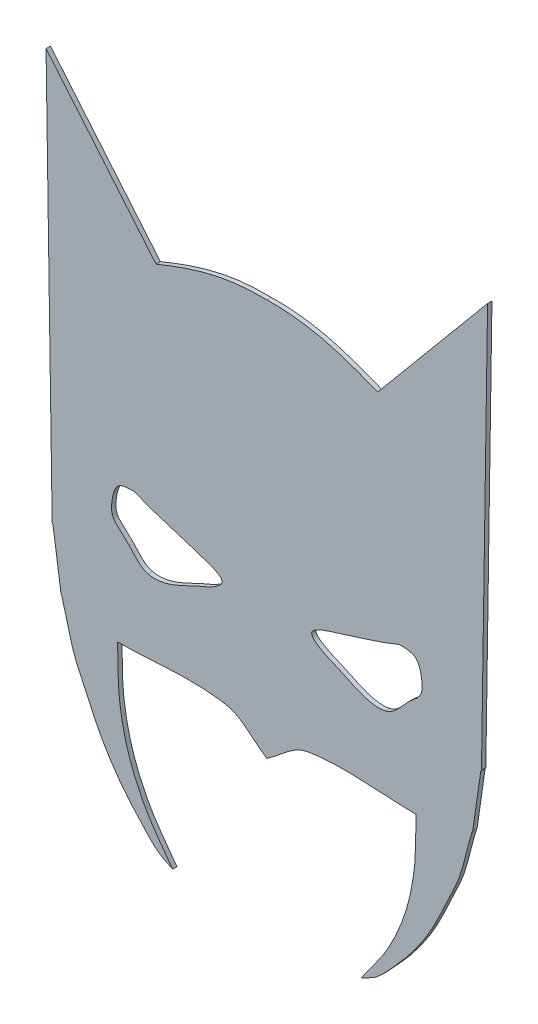
ISO-10303-21;
HEADER;
FILE_DESCRIPTION(('STEP AP214'),'2;1');
FILE_NAME('part.step','',(''),(''),'','','');
FILE_SCHEMA(('AUTOMOTIVE_DESIGN { 1 0 10303 214 1 1 1 1 }'));
ENDSEC;
DATA;
#1=APPLICATION_CONTEXT('core data for automotive mechanical design processes');
#2=APPLICATION_PROTOCOL_DEFINITION('international standard','automotive_design',2000,#1);
#3=PRODUCT_CONTEXT('',#1,'mechanical');
#4=PRODUCT('Part','Part','',(#3));
#5=PRODUCT_RELATED_PRODUCT_CATEGORY('part','',(#4));
#6=PRODUCT_DEFINITION_FORMATION('','',#4);
#7=PRODUCT_DEFINITION_CONTEXT('part definition',#1,'design');
#8=PRODUCT_DEFINITION('design','',#6,#7);
#9=PRODUCT_DEFINITION_SHAPE('','',#8);
#10=(LENGTH_UNIT() NAMED_UNIT(*) SI_UNIT(.MILLI.,.METRE.));
#11=(NAMED_UNIT(*) PLANE_ANGLE_UNIT() SI_UNIT($,.RADIAN.));
#12=(NAMED_UNIT(*) SI_UNIT($,.STERADIAN.) SOLID_ANGLE_UNIT());
#13=UNCERTAINTY_MEASURE_WITH_UNIT(LENGTH_MEASURE(1.E-05),#10,'distance_accuracy_value','');
#14=(GEOMETRIC_REPRESENTATION_CONTEXT(3) GLOBAL_UNCERTAINTY_ASSIGNED_CONTEXT((#13)) GLOBAL_UNIT_ASSIGNED_CONTEXT((#10,
#11,#12)) REPRESENTATION_CONTEXT('',''));
#15=CARTESIAN_POINT('',(0.,0.,0.));
#16=DIRECTION('',(0.,0.,1.));
#17=DIRECTION('',(1.,0.,0.));
#18=AXIS2_PLACEMENT_3D('',#15,#16,#17);
#19=CARTESIAN_POINT('',(293.908129118495,755.03354198734,5.));
#20=DIRECTION('',(0.,0.,-1.));
#21=DIRECTION('',(-1.,0.,0.));
#22=AXIS2_PLACEMENT_3D('',#19,#20,#21);
#23=PLANE('',#22);
#24=CARTESIAN_POINT('',(223.,422.000000000001,5.));
#25=CARTESIAN_POINT('',(241.565185989729,417.780639547789,5.));
#26=CARTESIAN_POINT('',(262.475974061569,430.564188327707,5.));
#27=CARTESIAN_POINT('',(279.,438.,5.));
#28=CARTESIAN_POINT('',(280.75701930223,438.790658686004,5.));
#29=CARTESIAN_POINT('',(317.580734699677,452.013760928803,5.));
#30=CARTESIAN_POINT('',(305.,461.,5.));
#31=CARTESIAN_POINT('',(301.36087328563,463.59937622455,5.));
#32=CARTESIAN_POINT('',(297.218889993597,465.516434287966,5.));
#33=CARTESIAN_POINT('',(293.,467.,5.));
#34=CARTESIAN_POINT('',(264.460492004454,477.035870943489,5.));
#35=CARTESIAN_POINT('',(234.806563628807,484.08290130194,5.));
#36=CARTESIAN_POINT('',(207.,496.,5.));
#37=B_SPLINE_CURVE_WITH_KNOTS('',3,(#24,#25,#26,#27,#28,#29,#30,#31,#32,#33,#34,#35,#36),
.UNSPECIFIED.,.F.,.F.,(4,3,3,3,4),(5.,6.,7.,8.,9.),.UNSPECIFIED.);
#38=CARTESIAN_POINT('',(223.,422.000000000001,5.));
#39=VERTEX_POINT('',#38);
#40=CARTESIAN_POINT('',(207.,496.,5.));
#41=VERTEX_POINT('',#40);
#42=EDGE_CURVE('E187',#39,#41,#37,.T.);
#43=ORIENTED_EDGE('',*,*,#42,.F.);
#44=CARTESIAN_POINT('',(207.,496.,5.));
#45=CARTESIAN_POINT('',(198.42482415111,495.387487439365,5.));
#46=CARTESIAN_POINT('',(189.089897125206,496.543093292148,5.));
#47=CARTESIAN_POINT('',(185.,487.,5.));
#48=CARTESIAN_POINT('',(183.629120594353,483.801281386823,5.));
#49=CARTESIAN_POINT('',(182.572125272407,480.432751634445,5.));
#50=CARTESIAN_POINT('',(182.,477.,5.));
#51=CARTESIAN_POINT('',(180.758499827501,469.550998965008,5.));
#52=CARTESIAN_POINT('',(179.710822546428,461.347012944286,5.));
#53=CARTESIAN_POINT('',(185.,455.,5.));
#54=CARTESIAN_POINT('',(188.47381566352,450.831421203776,5.));
#55=CARTESIAN_POINT('',(193.070629511286,447.742257608299,5.));
#56=CARTESIAN_POINT('',(197.,444.,5.));
#57=CARTESIAN_POINT('',(204.470837002454,436.88491714052,5.));
#58=CARTESIAN_POINT('',(212.218702562215,424.450294872224,5.));
#59=CARTESIAN_POINT('',(223.,422.000000000001,5.));
#60=B_SPLINE_CURVE_WITH_KNOTS('',3,(#44,#45,#46,#47,#48,#49,#50,#51,#52,#53,#54,#55,#56,#57,#58,
#59),.UNSPECIFIED.,.F.,.F.,(4,3,3,3,3,4),(0.,1.,2.,3.,4.,5.),.UNSPECIFIED.);
#61=EDGE_CURVE('E181',#41,#39,#60,.T.);
#62=ORIENTED_EDGE('',*,*,#61,.F.);
#63=EDGE_LOOP('',(#43,#62));
#64=FACE_BOUND('',#63,.T.);
#65=CARTESIAN_POINT('',(359.,762.027511398945,5.));
#66=CARTESIAN_POINT('',(311.942070824744,763.23255689008,5.));
#67=CARTESIAN_POINT('',(274.812940157912,751.514384609899,5.));
#68=CARTESIAN_POINT('',(231.999999999996,733.999999999842,5.));
#69=B_SPLINE_CURVE_WITH_KNOTS('',3,(#65,#66,#67,#68),.UNSPECIFIED.,.F.,.F.,(4,4),
(2.00702319968057,3.),.UNSPECIFIED.);
#70=CARTESIAN_POINT('',(359.,762.027511398945,5.));
#71=VERTEX_POINT('',#70);
#72=CARTESIAN_POINT('',(231.999999999996,733.999999999842,5.));
#73=VERTEX_POINT('',#72);
#74=EDGE_CURVE('E216',#71,#73,#69,.T.);
#75=ORIENTED_EDGE('',*,*,#74,.T.);
#76=DIRECTION('',(-0.640684407948007,0.767804330159912,0.));
#77=VECTOR('',#76,1.);
#78=CARTESIAN_POINT('',(231.999999999996,733.999999999842,5.));
#79=LINE('',#78,#77);
#80=CARTESIAN_POINT('',(105.999999999996,884.999999999842,5.));
#81=VERTEX_POINT('',#80);
#82=EDGE_CURVE('E222',#73,#81,#79,.T.);
#83=ORIENTED_EDGE('',*,*,#82,.T.);
#84=DIRECTION('',(0.0149876097565079,-0.999887679468943,0.));
#85=VECTOR('',#84,1.);
#86=CARTESIAN_POINT('',(105.999999999996,884.999999999842,5.));
#87=LINE('',#86,#85);
#88=CARTESIAN_POINT('',(113.,418.,5.));
#89=VERTEX_POINT('',#88);
#90=EDGE_CURVE('E228',#81,#89,#87,.T.);
#91=ORIENTED_EDGE('',*,*,#90,.T.);
#92=CARTESIAN_POINT('',(113.,418.,5.));
#93=CARTESIAN_POINT('',(113.333333333333,417.333333333334,5.));
#94=CARTESIAN_POINT('',(113.886663266514,416.736688767662,5.));
#95=CARTESIAN_POINT('',(114.,416.,5.));
#96=CARTESIAN_POINT('',(117.225619983423,395.033470107752,5.));
#97=CARTESIAN_POINT('',(119.774380016577,373.966529892249,5.));
#98=CARTESIAN_POINT('',(123.,353.,5.));
#99=CARTESIAN_POINT('',(123.113336733486,352.263311232339,5.));
#100=CARTESIAN_POINT('',(123.780801350259,351.712395611657,5.));
#101=CARTESIAN_POINT('',(124.,351.,5.));
#102=CARTESIAN_POINT('',(130.666666666667,329.333333333334,5.));
#103=CARTESIAN_POINT('',(133.991411170932,306.340035362299,5.));
#104=CARTESIAN_POINT('',(144.,286.,5.));
#105=CARTESIAN_POINT('',(154.004259854458,265.668762231263,5.));
#106=CARTESIAN_POINT('',(162.3686174324,244.446217730206,5.));
#107=CARTESIAN_POINT('',(174.,225.,5.));
#108=CARTESIAN_POINT('',(183.787460076766,208.636590184156,5.));
#109=CARTESIAN_POINT('',(195.254681469711,193.181410759055,5.));
#110=CARTESIAN_POINT('',(208.,179.,5.));
#111=CARTESIAN_POINT('',(232.73407639565,151.478985418925,5.));
#112=CARTESIAN_POINT('',(232.104070091007,152.447964954497,5.));
#113=CARTESIAN_POINT('',(251.,143.,5.));
#114=B_SPLINE_CURVE_WITH_KNOTS('',3,(#92,#93,#94,#95,#96,#97,#98,#99,#100,#101,#102,#103,#104,
#105,#106,#107,#108,#109,#110,#111,#112,#113),.UNSPECIFIED.,.F.,.F.,(4,3,3,3,3,3,3,4),(0.,1.,2.,
3.,4.,5.,6.,7.),.UNSPECIFIED.);
#115=CARTESIAN_POINT('',(251.,143.,5.));
#116=VERTEX_POINT('',#115);
#117=EDGE_CURVE('E230',#89,#116,#114,.T.);
#118=ORIENTED_EDGE('',*,*,#117,.T.);
#119=CARTESIAN_POINT('',(251.,143.,5.));
#120=CARTESIAN_POINT('',(240.666666666667,158.,5.));
#121=CARTESIAN_POINT('',(228.905113564775,172.110483639323,5.));
#122=CARTESIAN_POINT('',(220.,188.000000000001,5.));
#123=CARTESIAN_POINT('',(211.825713052404,202.585492396691,5.));
#124=CARTESIAN_POINT('',(205.083525843753,218.071619022907,5.));
#125=CARTESIAN_POINT('',(200.,234.,5.));
#126=CARTESIAN_POINT('',(195.030909012465,249.569818427609,5.));
#127=CARTESIAN_POINT('',(191.89130861194,265.766267747511,5.));
#128=CARTESIAN_POINT('',(190.,282.,5.));
#129=CARTESIAN_POINT('',(187.877025366053,300.222198941379,5.));
#130=CARTESIAN_POINT('',(188.666666666667,318.666666666667,5.));
#131=CARTESIAN_POINT('',(188.,337.,5.));
#132=B_SPLINE_CURVE_WITH_KNOTS('',3,(#119,#120,#121,#122,#123,#124,#125,#126,#127,#128,#129,
#130,#131),.UNSPECIFIED.,.F.,.F.,(4,3,3,3,4),(0.,1.,2.,3.,4.),.UNSPECIFIED.);
#133=CARTESIAN_POINT('',(188.,337.,5.));
#134=VERTEX_POINT('',#133);
#135=EDGE_CURVE('E235',#116,#134,#132,.T.);
#136=ORIENTED_EDGE('',*,*,#135,.T.);
#137=CARTESIAN_POINT('',(188.,337.,5.));
#138=CARTESIAN_POINT('',(229.333333333333,337.,5.));
#139=CARTESIAN_POINT('',(271.288442981286,344.142378424336,5.));
#140=CARTESIAN_POINT('',(312.,337.,5.));
#141=CARTESIAN_POINT('',(330.306545029652,333.788325433395,5.));
#142=CARTESIAN_POINT('',(343.333333333333,317.000000000001,5.));
#143=CARTESIAN_POINT('',(359.,307.000000000001,5.));
#144=B_SPLINE_CURVE_WITH_KNOTS('',3,(#137,#138,#139,#140,#141,#142,#143),.UNSPECIFIED.,.F.,.F.,
(4,3,4),(0.,1.,2.),.UNSPECIFIED.);
#145=CARTESIAN_POINT('',(359.,307.000000000001,5.));
#146=VERTEX_POINT('',#145);
#147=EDGE_CURVE('E398',#134,#146,#144,.T.);
#148=ORIENTED_EDGE('',*,*,#147,.T.);
#149=CARTESIAN_POINT('',(359.,307.000000000001,5.));
#150=CARTESIAN_POINT('',(374.666666666667,317.,5.));
#151=CARTESIAN_POINT('',(387.693454970348,333.788325433395,5.));
#152=CARTESIAN_POINT('',(406.,337.,5.));
#153=CARTESIAN_POINT('',(446.711557018714,344.142378424336,5.));
#154=CARTESIAN_POINT('',(488.666666666667,337.,5.));
#155=CARTESIAN_POINT('',(530.,337.,5.));
#156=B_SPLINE_CURVE_WITH_KNOTS('',3,(#149,#150,#151,#152,#153,#154,#155),.UNSPECIFIED.,.F.,.F.,
(4,3,4),(0.,1.,2.),.UNSPECIFIED.);
#157=CARTESIAN_POINT('',(530.,337.,5.));
#158=VERTEX_POINT('',#157);
#159=EDGE_CURVE('E399',#146,#158,#156,.T.);
#160=ORIENTED_EDGE('',*,*,#159,.T.);
#161=CARTESIAN_POINT('',(530.,337.,5.));
#162=CARTESIAN_POINT('',(529.333333333333,318.666666666667,5.));
#163=CARTESIAN_POINT('',(530.122974633947,300.222198941378,5.));
#164=CARTESIAN_POINT('',(528.,282.,5.));
#165=CARTESIAN_POINT('',(526.108691388059,265.766267747511,5.));
#166=CARTESIAN_POINT('',(522.969090987535,249.569818427609,5.));
#167=CARTESIAN_POINT('',(518.,234.,5.));
#168=CARTESIAN_POINT('',(512.916474156247,218.071619022906,5.));
#169=CARTESIAN_POINT('',(506.174286947596,202.585492396691,5.));
#170=CARTESIAN_POINT('',(498.,188.,5.));
#171=CARTESIAN_POINT('',(489.094886435225,172.110483639323,5.));
#172=CARTESIAN_POINT('',(477.333333333333,158.,5.));
#173=CARTESIAN_POINT('',(467.,143.,5.));
#174=B_SPLINE_CURVE_WITH_KNOTS('',3,(#161,#162,#163,#164,#165,#166,#167,#168,#169,#170,#171,
#172,#173),.UNSPECIFIED.,.F.,.F.,(4,3,3,3,4),(0.,1.,2.,3.,4.),.UNSPECIFIED.);
#175=CARTESIAN_POINT('',(467.,143.,5.));
#176=VERTEX_POINT('',#175);
#177=EDGE_CURVE('E401',#158,#176,#174,.T.);
#178=ORIENTED_EDGE('',*,*,#177,.T.);
#179=CARTESIAN_POINT('',(467.,143.,5.));
#180=CARTESIAN_POINT('',(485.895929908993,152.447964954496,5.));
#181=CARTESIAN_POINT('',(485.26592360435,151.478985418924,5.));
#182=CARTESIAN_POINT('',(510.,179.,5.));
#183=CARTESIAN_POINT('',(522.745318530289,193.181410759054,5.));
#184=CARTESIAN_POINT('',(534.212539923234,208.636590184156,5.));
#185=CARTESIAN_POINT('',(544.,225.,5.));
#186=CARTESIAN_POINT('',(555.6313825676,244.446217730206,5.));
#187=CARTESIAN_POINT('',(563.995740145542,265.668762231263,5.));
#188=CARTESIAN_POINT('',(574.,286.,5.));
#189=CARTESIAN_POINT('',(584.008588829068,306.340035362298,5.));
#190=CARTESIAN_POINT('',(587.333333333333,329.333333333333,5.));
#191=CARTESIAN_POINT('',(594.,351.,5.));
#192=CARTESIAN_POINT('',(594.219198649741,351.712395611657,5.));
#193=CARTESIAN_POINT('',(594.886663266514,352.263311232339,5.));
#194=CARTESIAN_POINT('',(595.,353.,5.));
#195=CARTESIAN_POINT('',(598.225619983423,373.966529892248,5.));
#196=CARTESIAN_POINT('',(600.774380016577,395.033470107752,5.));
#197=CARTESIAN_POINT('',(604.,416.,5.));
#198=CARTESIAN_POINT('',(604.113336733486,416.736688767661,5.));
#199=CARTESIAN_POINT('',(604.666666666667,417.333333333333,5.));
#200=CARTESIAN_POINT('',(605.,418.,5.));
#201=B_SPLINE_CURVE_WITH_KNOTS('',3,(#179,#180,#181,#182,#183,#184,#185,#186,#187,#188,#189,
#190,#191,#192,#193,#194,#195,#196,#197,#198,#199,#200),.UNSPECIFIED.,.F.,.F.,(4,3,3,3,3,3,3,4),
(0.,1.,2.,3.,4.,5.,6.,7.),.UNSPECIFIED.);
#202=CARTESIAN_POINT('',(605.,418.,5.));
#203=VERTEX_POINT('',#202);
#204=EDGE_CURVE('E430',#176,#203,#201,.T.);
#205=ORIENTED_EDGE('',*,*,#204,.T.);
#206=DIRECTION('',(0.0149876097565079,0.999887679468942,0.));
#207=VECTOR('',#206,1.);
#208=CARTESIAN_POINT('',(612.000000000004,884.999999999842,5.));
#209=LINE('',#208,#207);
#210=CARTESIAN_POINT('',(612.000000000004,884.999999999842,5.));
#211=VERTEX_POINT('',#210);
#212=EDGE_CURVE('E437',#203,#211,#209,.T.);
#213=ORIENTED_EDGE('',*,*,#212,.T.);
#214=DIRECTION('',(-0.640684407948007,-0.767804330159913,0.));
#215=VECTOR('',#214,1.);
#216=CARTESIAN_POINT('',(486.000000000004,733.999999999842,5.));
#217=LINE('',#216,#215);
#218=CARTESIAN_POINT('',(486.000000000004,733.999999999842,5.));
#219=VERTEX_POINT('',#218);
#220=EDGE_CURVE('E286',#211,#219,#217,.T.);
#221=ORIENTED_EDGE('',*,*,#220,.T.);
#222=CARTESIAN_POINT('',(486.000000000004,733.999999999842,5.));
#223=CARTESIAN_POINT('',(443.187059842088,751.514384609899,5.));
#224=CARTESIAN_POINT('',(406.057929175256,763.23255689008,5.));
#225=CARTESIAN_POINT('',(359.,762.027511398945,5.));
#226=B_SPLINE_CURVE_WITH_KNOTS('',3,(#222,#223,#224,#225),.UNSPECIFIED.,.F.,.F.,(4,4),
(2.00702319968057,3.),.UNSPECIFIED.);
#227=EDGE_CURVE('E279',#219,#71,#226,.T.);
#228=ORIENTED_EDGE('',*,*,#227,.T.);
#229=EDGE_LOOP('',(#75,#83,#91,#118,#136,#148,#160,#178,#205,#213,#221,#228));
#230=FACE_BOUND('',#229,.T.);
#231=CARTESIAN_POINT('',(495.,422.,5.));
#232=CARTESIAN_POINT('',(505.781297437785,424.450294872224,5.));
#233=CARTESIAN_POINT('',(513.529162997546,436.88491714052,5.));
#234=CARTESIAN_POINT('',(521.,444.,5.));
#235=CARTESIAN_POINT('',(524.929370488714,447.742257608299,5.));
#236=CARTESIAN_POINT('',(529.52618433648,450.831421203776,5.));
#237=CARTESIAN_POINT('',(533.,455.,5.));
#238=CARTESIAN_POINT('',(538.289177453571,461.347012944286,5.));
#239=CARTESIAN_POINT('',(537.241500172499,469.550998965008,5.));
#240=CARTESIAN_POINT('',(536.,477.,5.));
#241=CARTESIAN_POINT('',(535.427874727593,480.432751634445,5.));
#242=CARTESIAN_POINT('',(534.370879405647,483.801281386823,5.));
#243=CARTESIAN_POINT('',(533.,487.,5.));
#244=CARTESIAN_POINT('',(528.910102874794,496.543093292148,5.));
#245=CARTESIAN_POINT('',(519.575175848889,495.387487439365,5.));
#246=CARTESIAN_POINT('',(511.,496.,5.));
#247=B_SPLINE_CURVE_WITH_KNOTS('',3,(#231,#232,#233,#234,#235,#236,#237,#238,#239,#240,#241,
#242,#243,#244,#245,#246),.UNSPECIFIED.,.F.,.F.,(4,3,3,3,3,4),(0.,1.,2.,3.,4.,5.),.UNSPECIFIED.);
#248=CARTESIAN_POINT('',(495.,422.,5.));
#249=VERTEX_POINT('',#248);
#250=CARTESIAN_POINT('',(511.,496.,5.));
#251=VERTEX_POINT('',#250);
#252=EDGE_CURVE('E152',#249,#251,#247,.T.);
#253=ORIENTED_EDGE('',*,*,#252,.F.);
#254=CARTESIAN_POINT('',(511.,496.,5.));
#255=CARTESIAN_POINT('',(483.193436371193,484.08290130194,5.));
#256=CARTESIAN_POINT('',(453.539507995546,477.035870943489,5.));
#257=CARTESIAN_POINT('',(425.,467.,5.));
#258=CARTESIAN_POINT('',(420.781110006403,465.516434287966,5.));
#259=CARTESIAN_POINT('',(416.63912671437,463.59937622455,5.));
#260=CARTESIAN_POINT('',(413.,461.,5.));
#261=CARTESIAN_POINT('',(400.419265300323,452.013760928802,5.));
#262=CARTESIAN_POINT('',(437.24298069777,438.790658686003,5.));
#263=CARTESIAN_POINT('',(439.,438.,5.));
#264=CARTESIAN_POINT('',(455.524025938431,430.564188327706,5.));
#265=CARTESIAN_POINT('',(476.434814010271,417.780639547789,5.));
#266=CARTESIAN_POINT('',(495.,422.,5.));
#267=B_SPLINE_CURVE_WITH_KNOTS('',3,(#254,#255,#256,#257,#258,#259,#260,#261,#262,#263,#264,
#265,#266),.UNSPECIFIED.,.F.,.F.,(4,3,3,3,4),(5.,6.,7.,8.,9.),.UNSPECIFIED.);
#268=EDGE_CURVE('E146',#251,#249,#267,.T.);
#269=ORIENTED_EDGE('',*,*,#268,.F.);
#270=EDGE_LOOP('',(#253,#269));
#271=FACE_BOUND('',#270,.T.);
#272=ADVANCED_FACE('F33',(#64,#230,#271),#23,.F.);
#273=CARTESIAN_POINT('',(293.908129118495,755.03354198734,0.));
#274=DIRECTION('',(0.,0.,-1.));
#275=DIRECTION('',(-1.,0.,0.));
#276=AXIS2_PLACEMENT_3D('',#273,#274,#275);
#277=PLANE('',#276);
#278=CARTESIAN_POINT('',(359.,762.027511398945,0.));
#279=CARTESIAN_POINT('',(311.942070824744,763.23255689008,0.));
#280=CARTESIAN_POINT('',(274.812940157912,751.514384609899,0.));
#281=CARTESIAN_POINT('',(231.999999999996,733.999999999842,0.));
#282=B_SPLINE_CURVE_WITH_KNOTS('',3,(#278,#279,#280,#281),.UNSPECIFIED.,.F.,.F.,(4,4),
(2.00702319968057,3.),.UNSPECIFIED.);
#283=CARTESIAN_POINT('',(359.,762.027511398945,0.));
#284=VERTEX_POINT('',#283);
#285=CARTESIAN_POINT('',(231.999999999996,733.999999999842,0.));
#286=VERTEX_POINT('',#285);
#287=EDGE_CURVE('E215',#284,#286,#282,.T.);
#288=ORIENTED_EDGE('',*,*,#287,.F.);
#289=CARTESIAN_POINT('',(486.000000000004,733.999999999842,0.));
#290=CARTESIAN_POINT('',(443.187059842088,751.514384609899,0.));
#291=CARTESIAN_POINT('',(406.057929175256,763.23255689008,0.));
#292=CARTESIAN_POINT('',(359.,762.027511398945,0.));
#293=B_SPLINE_CURVE_WITH_KNOTS('',3,(#289,#290,#291,#292),.UNSPECIFIED.,.F.,.F.,(4,4),
(2.00702319968057,3.),.UNSPECIFIED.);
#294=CARTESIAN_POINT('',(486.000000000004,733.999999999842,0.));
#295=VERTEX_POINT('',#294);
#296=EDGE_CURVE('E223',#295,#284,#293,.T.);
#297=ORIENTED_EDGE('',*,*,#296,.F.);
#298=DIRECTION('',(-0.640684407948007,-0.767804330159913,0.));
#299=VECTOR('',#298,1.);
#300=CARTESIAN_POINT('',(486.000000000004,733.999999999842,0.));
#301=LINE('',#300,#299);
#302=CARTESIAN_POINT('',(612.000000000004,884.999999999842,0.));
#303=VERTEX_POINT('',#302);
#304=EDGE_CURVE('E346',#303,#295,#301,.T.);
#305=ORIENTED_EDGE('',*,*,#304,.F.);
#306=DIRECTION('',(0.0149876097565079,0.999887679468942,0.));
#307=VECTOR('',#306,1.);
#308=CARTESIAN_POINT('',(612.000000000004,884.999999999842,0.));
#309=LINE('',#308,#307);
#310=CARTESIAN_POINT('',(605.,418.,0.));
#311=VERTEX_POINT('',#310);
#312=EDGE_CURVE('E341',#311,#303,#309,.T.);
#313=ORIENTED_EDGE('',*,*,#312,.F.);
#314=CARTESIAN_POINT('',(467.,143.,0.));
#315=CARTESIAN_POINT('',(485.895929908993,152.447964954496,0.));
#316=CARTESIAN_POINT('',(485.26592360435,151.478985418924,0.));
#317=CARTESIAN_POINT('',(510.,179.,0.));
#318=CARTESIAN_POINT('',(522.745318530289,193.181410759054,0.));
#319=CARTESIAN_POINT('',(534.212539923234,208.636590184156,0.));
#320=CARTESIAN_POINT('',(544.,225.,0.));
#321=CARTESIAN_POINT('',(555.6313825676,244.446217730206,0.));
#322=CARTESIAN_POINT('',(563.995740145542,265.668762231263,0.));
#323=CARTESIAN_POINT('',(574.,286.,0.));
#324=CARTESIAN_POINT('',(584.008588829068,306.340035362298,0.));
#325=CARTESIAN_POINT('',(587.333333333333,329.333333333333,0.));
#326=CARTESIAN_POINT('',(594.,351.,0.));
#327=CARTESIAN_POINT('',(594.219198649741,351.712395611657,0.));
#328=CARTESIAN_POINT('',(594.886663266514,352.263311232339,0.));
#329=CARTESIAN_POINT('',(595.,353.,0.));
#330=CARTESIAN_POINT('',(598.225619983423,373.966529892248,0.));
#331=CARTESIAN_POINT('',(600.774380016577,395.033470107752,0.));
#332=CARTESIAN_POINT('',(604.,416.,0.));
#333=CARTESIAN_POINT('',(604.113336733486,416.736688767661,0.));
#334=CARTESIAN_POINT('',(604.666666666667,417.333333333333,0.));
#335=CARTESIAN_POINT('',(605.,418.,0.));
#336=B_SPLINE_CURVE_WITH_KNOTS('',3,(#314,#315,#316,#317,#318,#319,#320,#321,#322,#323,#324,
#325,#326,#327,#328,#329,#330,#331,#332,#333,#334,#335),.UNSPECIFIED.,.F.,.F.,(4,3,3,3,3,3,3,4),
(0.,1.,2.,3.,4.,5.,6.,7.),.UNSPECIFIED.);
#337=CARTESIAN_POINT('',(467.,143.,0.));
#338=VERTEX_POINT('',#337);
#339=EDGE_CURVE('E334',#338,#311,#336,.T.);
#340=ORIENTED_EDGE('',*,*,#339,.F.);
#341=CARTESIAN_POINT('',(530.,337.,0.));
#342=CARTESIAN_POINT('',(529.333333333333,318.666666666667,0.));
#343=CARTESIAN_POINT('',(530.122974633947,300.222198941378,0.));
#344=CARTESIAN_POINT('',(528.,282.,0.));
#345=CARTESIAN_POINT('',(526.108691388059,265.766267747511,0.));
#346=CARTESIAN_POINT('',(522.969090987535,249.569818427609,0.));
#347=CARTESIAN_POINT('',(518.,234.,0.));
#348=CARTESIAN_POINT('',(512.916474156247,218.071619022906,0.));
#349=CARTESIAN_POINT('',(506.174286947596,202.585492396691,0.));
#350=CARTESIAN_POINT('',(498.,188.,0.));
#351=CARTESIAN_POINT('',(489.094886435225,172.110483639323,0.));
#352=CARTESIAN_POINT('',(477.333333333333,158.,0.));
#353=CARTESIAN_POINT('',(467.,143.,0.));
#354=B_SPLINE_CURVE_WITH_KNOTS('',3,(#341,#342,#343,#344,#345,#346,#347,#348,#349,#350,#351,
#352,#353),.UNSPECIFIED.,.F.,.F.,(4,3,3,3,4),(0.,1.,2.,3.,4.),.UNSPECIFIED.);
#355=CARTESIAN_POINT('',(530.,337.,0.));
#356=VERTEX_POINT('',#355);
#357=EDGE_CURVE('E327',#356,#338,#354,.T.);
#358=ORIENTED_EDGE('',*,*,#357,.F.);
#359=CARTESIAN_POINT('',(359.,307.000000000001,0.));
#360=CARTESIAN_POINT('',(374.666666666667,317.,0.));
#361=CARTESIAN_POINT('',(387.693454970348,333.788325433395,0.));
#362=CARTESIAN_POINT('',(406.,337.,0.));
#363=CARTESIAN_POINT('',(446.711557018714,344.142378424336,0.));
#364=CARTESIAN_POINT('',(488.666666666667,337.,0.));
#365=CARTESIAN_POINT('',(530.,337.,0.));
#366=B_SPLINE_CURVE_WITH_KNOTS('',3,(#359,#360,#361,#362,#363,#364,#365),.UNSPECIFIED.,.F.,.F.,
(4,3,4),(0.,1.,2.),.UNSPECIFIED.);
#367=CARTESIAN_POINT('',(359.,307.000000000001,0.));
#368=VERTEX_POINT('',#367);
#369=EDGE_CURVE('E320',#368,#356,#366,.T.);
#370=ORIENTED_EDGE('',*,*,#369,.F.);
#371=CARTESIAN_POINT('',(188.,337.,0.));
#372=CARTESIAN_POINT('',(229.333333333333,337.,0.));
#373=CARTESIAN_POINT('',(271.288442981286,344.142378424336,0.));
#374=CARTESIAN_POINT('',(312.,337.,0.));
#375=CARTESIAN_POINT('',(330.306545029652,333.788325433395,0.));
#376=CARTESIAN_POINT('',(343.333333333333,317.000000000001,0.));
#377=CARTESIAN_POINT('',(359.,307.000000000001,0.));
#378=B_SPLINE_CURVE_WITH_KNOTS('',3,(#371,#372,#373,#374,#375,#376,#377),.UNSPECIFIED.,.F.,.F.,
(4,3,4),(0.,1.,2.),.UNSPECIFIED.);
#379=CARTESIAN_POINT('',(188.,337.,0.));
#380=VERTEX_POINT('',#379);
#381=EDGE_CURVE('E313',#380,#368,#378,.T.);
#382=ORIENTED_EDGE('',*,*,#381,.F.);
#383=CARTESIAN_POINT('',(251.,143.,0.));
#384=CARTESIAN_POINT('',(240.666666666667,158.,0.));
#385=CARTESIAN_POINT('',(228.905113564775,172.110483639323,0.));
#386=CARTESIAN_POINT('',(220.,188.000000000001,0.));
#387=CARTESIAN_POINT('',(211.825713052404,202.585492396691,0.));
#388=CARTESIAN_POINT('',(205.083525843753,218.071619022907,0.));
#389=CARTESIAN_POINT('',(200.,234.,0.));
#390=CARTESIAN_POINT('',(195.030909012465,249.569818427609,0.));
#391=CARTESIAN_POINT('',(191.89130861194,265.766267747511,0.));
#392=CARTESIAN_POINT('',(190.,282.,0.));
#393=CARTESIAN_POINT('',(187.877025366053,300.222198941379,0.));
#394=CARTESIAN_POINT('',(188.666666666667,318.666666666667,0.));
#395=CARTESIAN_POINT('',(188.,337.,0.));
#396=B_SPLINE_CURVE_WITH_KNOTS('',3,(#383,#384,#385,#386,#387,#388,#389,#390,#391,#392,#393,
#394,#395),.UNSPECIFIED.,.F.,.F.,(4,3,3,3,4),(0.,1.,2.,3.,4.),.UNSPECIFIED.);
#397=CARTESIAN_POINT('',(251.,143.,0.));
#398=VERTEX_POINT('',#397);
#399=EDGE_CURVE('E306',#398,#380,#396,.T.);
#400=ORIENTED_EDGE('',*,*,#399,.F.);
#401=CARTESIAN_POINT('',(113.,418.,0.));
#402=CARTESIAN_POINT('',(113.333333333333,417.333333333334,0.));
#403=CARTESIAN_POINT('',(113.886663266514,416.736688767662,0.));
#404=CARTESIAN_POINT('',(114.,416.,0.));
#405=CARTESIAN_POINT('',(117.225619983423,395.033470107752,0.));
#406=CARTESIAN_POINT('',(119.774380016577,373.966529892249,0.));
#407=CARTESIAN_POINT('',(123.,353.,0.));
#408=CARTESIAN_POINT('',(123.113336733486,352.263311232339,0.));
#409=CARTESIAN_POINT('',(123.780801350259,351.712395611657,0.));
#410=CARTESIAN_POINT('',(124.,351.,0.));
#411=CARTESIAN_POINT('',(130.666666666667,329.333333333334,0.));
#412=CARTESIAN_POINT('',(133.991411170932,306.340035362299,0.));
#413=CARTESIAN_POINT('',(144.,286.,0.));
#414=CARTESIAN_POINT('',(154.004259854458,265.668762231263,0.));
#415=CARTESIAN_POINT('',(162.3686174324,244.446217730206,0.));
#416=CARTESIAN_POINT('',(174.,225.,0.));
#417=CARTESIAN_POINT('',(183.787460076766,208.636590184156,0.));
#418=CARTESIAN_POINT('',(195.254681469711,193.181410759055,0.));
#419=CARTESIAN_POINT('',(208.,179.,0.));
#420=CARTESIAN_POINT('',(232.73407639565,151.478985418925,0.));
#421=CARTESIAN_POINT('',(232.104070091007,152.447964954497,0.));
#422=CARTESIAN_POINT('',(251.,143.,0.));
#423=B_SPLINE_CURVE_WITH_KNOTS('',3,(#401,#402,#403,#404,#405,#406,#407,#408,#409,#410,#411,
#412,#413,#414,#415,#416,#417,#418,#419,#420,#421,#422),.UNSPECIFIED.,.F.,.F.,(4,3,3,3,3,3,3,4),
(0.,1.,2.,3.,4.,5.,6.,7.),.UNSPECIFIED.);
#424=CARTESIAN_POINT('',(113.,418.,0.));
#425=VERTEX_POINT('',#424);
#426=EDGE_CURVE('E302',#425,#398,#423,.T.);
#427=ORIENTED_EDGE('',*,*,#426,.F.);
#428=DIRECTION('',(0.0149876097565079,-0.999887679468943,0.));
#429=VECTOR('',#428,1.);
#430=CARTESIAN_POINT('',(105.999999999996,884.999999999842,0.));
#431=LINE('',#430,#429);
#432=CARTESIAN_POINT('',(105.999999999996,884.999999999842,0.));
#433=VERTEX_POINT('',#432);
#434=EDGE_CURVE('E300',#433,#425,#431,.T.);
#435=ORIENTED_EDGE('',*,*,#434,.F.);
#436=DIRECTION('',(-0.640684407948007,0.767804330159912,0.));
#437=VECTOR('',#436,1.);
#438=CARTESIAN_POINT('',(231.999999999996,733.999999999842,0.));
#439=LINE('',#438,#437);
#440=EDGE_CURVE('E295',#286,#433,#439,.T.);
#441=ORIENTED_EDGE('',*,*,#440,.F.);
#442=EDGE_LOOP('',(#288,#297,#305,#313,#340,#358,#370,#382,#400,#427,#435,#441));
#443=FACE_BOUND('',#442,.T.);
#444=CARTESIAN_POINT('',(207.,496.,0.));
#445=CARTESIAN_POINT('',(198.42482415111,495.387487439365,0.));
#446=CARTESIAN_POINT('',(189.089897125206,496.543093292148,0.));
#447=CARTESIAN_POINT('',(185.,487.,0.));
#448=CARTESIAN_POINT('',(183.629120594353,483.801281386823,0.));
#449=CARTESIAN_POINT('',(182.572125272407,480.432751634445,0.));
#450=CARTESIAN_POINT('',(182.,477.,0.));
#451=CARTESIAN_POINT('',(180.758499827501,469.550998965008,0.));
#452=CARTESIAN_POINT('',(179.710822546428,461.347012944286,0.));
#453=CARTESIAN_POINT('',(185.,455.,0.));
#454=CARTESIAN_POINT('',(188.47381566352,450.831421203776,0.));
#455=CARTESIAN_POINT('',(193.070629511286,447.742257608299,0.));
#456=CARTESIAN_POINT('',(197.,444.,0.));
#457=CARTESIAN_POINT('',(204.470837002454,436.88491714052,0.));
#458=CARTESIAN_POINT('',(212.218702562215,424.450294872224,0.));
#459=CARTESIAN_POINT('',(223.,422.000000000001,0.));
#460=B_SPLINE_CURVE_WITH_KNOTS('',3,(#444,#445,#446,#447,#448,#449,#450,#451,#452,#453,#454,
#455,#456,#457,#458,#459),.UNSPECIFIED.,.F.,.F.,(4,3,3,3,3,4),(0.,1.,2.,3.,4.,5.),.UNSPECIFIED.);
#461=CARTESIAN_POINT('',(207.,496.,0.));
#462=VERTEX_POINT('',#461);
#463=CARTESIAN_POINT('',(223.,422.000000000001,0.));
#464=VERTEX_POINT('',#463);
#465=EDGE_CURVE('E200',#462,#464,#460,.T.);
#466=ORIENTED_EDGE('',*,*,#465,.T.);
#467=CARTESIAN_POINT('',(223.,422.000000000001,0.));
#468=CARTESIAN_POINT('',(241.565185989729,417.780639547789,0.));
#469=CARTESIAN_POINT('',(262.475974061569,430.564188327707,0.));
#470=CARTESIAN_POINT('',(279.,438.,0.));
#471=CARTESIAN_POINT('',(280.75701930223,438.790658686004,0.));
#472=CARTESIAN_POINT('',(317.580734699677,452.013760928803,0.));
#473=CARTESIAN_POINT('',(305.,461.,0.));
#474=CARTESIAN_POINT('',(301.36087328563,463.59937622455,0.));
#475=CARTESIAN_POINT('',(297.218889993597,465.516434287966,0.));
#476=CARTESIAN_POINT('',(293.,467.,0.));
#477=CARTESIAN_POINT('',(264.460492004454,477.035870943489,0.));
#478=CARTESIAN_POINT('',(234.806563628807,484.08290130194,0.));
#479=CARTESIAN_POINT('',(207.,496.,0.));
#480=B_SPLINE_CURVE_WITH_KNOTS('',3,(#467,#468,#469,#470,#471,#472,#473,#474,#475,#476,#477,
#478,#479),.UNSPECIFIED.,.F.,.F.,(4,3,3,3,4),(5.,6.,7.,8.,9.),.UNSPECIFIED.);
#481=EDGE_CURVE('E192',#464,#462,#480,.T.);
#482=ORIENTED_EDGE('',*,*,#481,.T.);
#483=EDGE_LOOP('',(#466,#482));
#484=FACE_BOUND('',#483,.T.);
#485=CARTESIAN_POINT('',(511.,496.,0.));
#486=CARTESIAN_POINT('',(483.193436371193,484.08290130194,0.));
#487=CARTESIAN_POINT('',(453.539507995546,477.035870943489,0.));
#488=CARTESIAN_POINT('',(425.,467.,0.));
#489=CARTESIAN_POINT('',(420.781110006403,465.516434287966,0.));
#490=CARTESIAN_POINT('',(416.63912671437,463.59937622455,0.));
#491=CARTESIAN_POINT('',(413.,461.,0.));
#492=CARTESIAN_POINT('',(400.419265300323,452.013760928802,0.));
#493=CARTESIAN_POINT('',(437.24298069777,438.790658686003,0.));
#494=CARTESIAN_POINT('',(439.,438.,0.));
#495=CARTESIAN_POINT('',(455.524025938431,430.564188327706,0.));
#496=CARTESIAN_POINT('',(476.434814010271,417.780639547789,0.));
#497=CARTESIAN_POINT('',(495.,422.,0.));
#498=B_SPLINE_CURVE_WITH_KNOTS('',3,(#485,#486,#487,#488,#489,#490,#491,#492,#493,#494,#495,
#496,#497),.UNSPECIFIED.,.F.,.F.,(4,3,3,3,4),(5.,6.,7.,8.,9.),.UNSPECIFIED.);
#499=CARTESIAN_POINT('',(511.,496.,0.));
#500=VERTEX_POINT('',#499);
#501=CARTESIAN_POINT('',(495.,422.,0.));
#502=VERTEX_POINT('',#501);
#503=EDGE_CURVE('E156',#500,#502,#498,.T.);
#504=ORIENTED_EDGE('',*,*,#503,.T.);
#505=CARTESIAN_POINT('',(495.,422.,0.));
#506=CARTESIAN_POINT('',(505.781297437785,424.450294872224,0.));
#507=CARTESIAN_POINT('',(513.529162997546,436.88491714052,0.));
#508=CARTESIAN_POINT('',(521.,444.,0.));
#509=CARTESIAN_POINT('',(524.929370488714,447.742257608299,0.));
#510=CARTESIAN_POINT('',(529.52618433648,450.831421203776,0.));
#511=CARTESIAN_POINT('',(533.,455.,0.));
#512=CARTESIAN_POINT('',(538.289177453571,461.347012944286,0.));
#513=CARTESIAN_POINT('',(537.241500172499,469.550998965008,0.));
#514=CARTESIAN_POINT('',(536.,477.,0.));
#515=CARTESIAN_POINT('',(535.427874727593,480.432751634445,0.));
#516=CARTESIAN_POINT('',(534.370879405647,483.801281386823,0.));
#517=CARTESIAN_POINT('',(533.,487.,0.));
#518=CARTESIAN_POINT('',(528.910102874794,496.543093292148,0.));
#519=CARTESIAN_POINT('',(519.575175848889,495.387487439365,0.));
#520=CARTESIAN_POINT('',(511.,496.,0.));
#521=B_SPLINE_CURVE_WITH_KNOTS('',3,(#505,#506,#507,#508,#509,#510,#511,#512,#513,#514,#515,
#516,#517,#518,#519,#520),.UNSPECIFIED.,.F.,.F.,(4,3,3,3,3,4),(0.,1.,2.,3.,4.,5.),.UNSPECIFIED.);
#522=EDGE_CURVE('E56',#502,#500,#521,.T.);
#523=ORIENTED_EDGE('',*,*,#522,.T.);
#524=EDGE_LOOP('',(#504,#523));
#525=FACE_BOUND('',#524,.T.);
#526=ADVANCED_FACE('F260',(#443,#484,#525),#277,.T.);
#527=DIRECTION('',(0.,0.,-1.));
#528=VECTOR('',#527,1.);
#529=SURFACE_OF_LINEAR_EXTRUSION('',#69,#528);
#530=ORIENTED_EDGE('',*,*,#287,.T.);
#531=DIRECTION('',(0.,0.,-1.));
#532=VECTOR('',#531,1.);
#533=CARTESIAN_POINT('',(231.999999999996,733.999999999842,5.));
#534=LINE('',#533,#532);
#535=EDGE_CURVE('E11',#73,#286,#534,.T.);
#536=ORIENTED_EDGE('',*,*,#535,.F.);
#537=ORIENTED_EDGE('',*,*,#74,.F.);
#538=DIRECTION('',(0.,0.,-1.));
#539=VECTOR('',#538,1.);
#540=CARTESIAN_POINT('',(359.,762.027511398945,5.));
#541=LINE('',#540,#539);
#542=EDGE_CURVE('E285',#71,#284,#541,.T.);
#543=ORIENTED_EDGE('',*,*,#542,.T.);
#544=EDGE_LOOP('',(#530,#536,#537,#543));
#545=FACE_BOUND('',#544,.T.);
#546=ADVANCED_FACE('F35',(#545),#529,.F.);
#547=CARTESIAN_POINT('',(231.999999999996,733.999999999842,5.));
#548=DIRECTION('',(-0.767804330159912,-0.640684407948007,0.));
#549=DIRECTION('',(0.640684407948007,-0.767804330159913,0.));
#550=AXIS2_PLACEMENT_3D('',#547,#548,#549);
#551=PLANE('',#550);
#552=ORIENTED_EDGE('',*,*,#440,.T.);
#553=DIRECTION('',(0.,0.,-1.));
#554=VECTOR('',#553,1.);
#555=CARTESIAN_POINT('',(105.999999999996,884.999999999842,5.));
#556=LINE('',#555,#554);
#557=EDGE_CURVE('E42',#81,#433,#556,.T.);
#558=ORIENTED_EDGE('',*,*,#557,.F.);
#559=ORIENTED_EDGE('',*,*,#82,.F.);
#560=ORIENTED_EDGE('',*,*,#535,.T.);
#561=EDGE_LOOP('',(#552,#558,#559,#560));
#562=FACE_BOUND('',#561,.T.);
#563=ADVANCED_FACE('F253',(#562),#551,.F.);
#564=CARTESIAN_POINT('',(105.999999999996,884.999999999842,5.));
#565=DIRECTION('',(0.999887679468943,0.0149876097565079,0.));
#566=DIRECTION('',(-0.0149876097565079,0.999887679468943,0.));
#567=AXIS2_PLACEMENT_3D('',#564,#565,#566);
#568=PLANE('',#567);
#569=ORIENTED_EDGE('',*,*,#434,.T.);
#570=DIRECTION('',(0.,0.,-1.));
#571=VECTOR('',#570,1.);
#572=CARTESIAN_POINT('',(113.,418.,5.));
#573=LINE('',#572,#571);
#574=EDGE_CURVE('E380',#89,#425,#573,.T.);
#575=ORIENTED_EDGE('',*,*,#574,.F.);
#576=ORIENTED_EDGE('',*,*,#90,.F.);
#577=ORIENTED_EDGE('',*,*,#557,.T.);
#578=EDGE_LOOP('',(#569,#575,#576,#577));
#579=FACE_BOUND('',#578,.T.);
#580=ADVANCED_FACE('F249',(#579),#568,.F.);
#581=DIRECTION('',(0.,0.,-1.));
#582=VECTOR('',#581,1.);
#583=SURFACE_OF_LINEAR_EXTRUSION('',#114,#582);
#584=ORIENTED_EDGE('',*,*,#426,.T.);
#585=DIRECTION('',(0.,0.,-1.));
#586=VECTOR('',#585,1.);
#587=CARTESIAN_POINT('',(251.,143.,5.));
#588=LINE('',#587,#586);
#589=EDGE_CURVE('E377',#116,#398,#588,.T.);
#590=ORIENTED_EDGE('',*,*,#589,.F.);
#591=ORIENTED_EDGE('',*,*,#117,.F.);
#592=ORIENTED_EDGE('',*,*,#574,.T.);
#593=EDGE_LOOP('',(#584,#590,#591,#592));
#594=FACE_BOUND('',#593,.T.);
#595=ADVANCED_FACE('F244',(#594),#583,.F.);
#596=DIRECTION('',(0.,0.,-1.));
#597=VECTOR('',#596,1.);
#598=SURFACE_OF_LINEAR_EXTRUSION('',#132,#597);
#599=ORIENTED_EDGE('',*,*,#399,.T.);
#600=DIRECTION('',(0.,0.,-1.));
#601=VECTOR('',#600,1.);
#602=CARTESIAN_POINT('',(188.,337.,5.));
#603=LINE('',#602,#601);
#604=EDGE_CURVE('E374',#134,#380,#603,.T.);
#605=ORIENTED_EDGE('',*,*,#604,.F.);
#606=ORIENTED_EDGE('',*,*,#135,.F.);
#607=ORIENTED_EDGE('',*,*,#589,.T.);
#608=EDGE_LOOP('',(#599,#605,#606,#607));
#609=FACE_BOUND('',#608,.T.);
#610=ADVANCED_FACE('F248',(#609),#598,.F.);
#611=DIRECTION('',(0.,0.,-1.));
#612=VECTOR('',#611,1.);
#613=SURFACE_OF_LINEAR_EXTRUSION('',#144,#612);
#614=ORIENTED_EDGE('',*,*,#381,.T.);
#615=DIRECTION('',(0.,0.,-1.));
#616=VECTOR('',#615,1.);
#617=CARTESIAN_POINT('',(359.,307.000000000001,5.));
#618=LINE('',#617,#616);
#619=EDGE_CURVE('E371',#146,#368,#618,.T.);
#620=ORIENTED_EDGE('',*,*,#619,.F.);
#621=ORIENTED_EDGE('',*,*,#147,.F.);
#622=ORIENTED_EDGE('',*,*,#604,.T.);
#623=EDGE_LOOP('',(#614,#620,#621,#622));
#624=FACE_BOUND('',#623,.T.);
#625=ADVANCED_FACE('F413',(#624),#613,.F.);
#626=DIRECTION('',(0.,0.,-1.));
#627=VECTOR('',#626,1.);
#628=SURFACE_OF_LINEAR_EXTRUSION('',#156,#627);
#629=ORIENTED_EDGE('',*,*,#369,.T.);
#630=DIRECTION('',(0.,0.,-1.));
#631=VECTOR('',#630,1.);
#632=CARTESIAN_POINT('',(530.,337.,5.));
#633=LINE('',#632,#631);
#634=EDGE_CURVE('E368',#158,#356,#633,.T.);
#635=ORIENTED_EDGE('',*,*,#634,.F.);
#636=ORIENTED_EDGE('',*,*,#159,.F.);
#637=ORIENTED_EDGE('',*,*,#619,.T.);
#638=EDGE_LOOP('',(#629,#635,#636,#637));
#639=FACE_BOUND('',#638,.T.);
#640=ADVANCED_FACE('F416',(#639),#628,.F.);
#641=DIRECTION('',(0.,0.,-1.));
#642=VECTOR('',#641,1.);
#643=SURFACE_OF_LINEAR_EXTRUSION('',#174,#642);
#644=ORIENTED_EDGE('',*,*,#357,.T.);
#645=DIRECTION('',(0.,0.,-1.));
#646=VECTOR('',#645,1.);
#647=CARTESIAN_POINT('',(467.,143.,5.));
#648=LINE('',#647,#646);
#649=EDGE_CURVE('E365',#176,#338,#648,.T.);
#650=ORIENTED_EDGE('',*,*,#649,.F.);
#651=ORIENTED_EDGE('',*,*,#177,.F.);
#652=ORIENTED_EDGE('',*,*,#634,.T.);
#653=EDGE_LOOP('',(#644,#650,#651,#652));
#654=FACE_BOUND('',#653,.T.);
#655=ADVANCED_FACE('F420',(#654),#643,.F.);
#656=DIRECTION('',(0.,0.,-1.));
#657=VECTOR('',#656,1.);
#658=SURFACE_OF_LINEAR_EXTRUSION('',#201,#657);
#659=ORIENTED_EDGE('',*,*,#339,.T.);
#660=DIRECTION('',(0.,0.,-1.));
#661=VECTOR('',#660,1.);
#662=CARTESIAN_POINT('',(605.,418.,5.));
#663=LINE('',#662,#661);
#664=EDGE_CURVE('E362',#203,#311,#663,.T.);
#665=ORIENTED_EDGE('',*,*,#664,.F.);
#666=ORIENTED_EDGE('',*,*,#204,.F.);
#667=ORIENTED_EDGE('',*,*,#649,.T.);
#668=EDGE_LOOP('',(#659,#665,#666,#667));
#669=FACE_BOUND('',#668,.T.);
#670=ADVANCED_FACE('F424',(#669),#658,.F.);
#671=CARTESIAN_POINT('',(612.000000000004,884.999999999842,5.));
#672=DIRECTION('',(-0.999887679468943,0.0149876097565079,0.));
#673=DIRECTION('',(-0.0149876097565079,-0.999887679468943,0.));
#674=AXIS2_PLACEMENT_3D('',#671,#672,#673);
#675=PLANE('',#674);
#676=ORIENTED_EDGE('',*,*,#312,.T.);
#677=DIRECTION('',(0.,0.,-1.));
#678=VECTOR('',#677,1.);
#679=CARTESIAN_POINT('',(612.000000000004,884.999999999842,5.));
#680=LINE('',#679,#678);
#681=EDGE_CURVE('E359',#211,#303,#680,.T.);
#682=ORIENTED_EDGE('',*,*,#681,.F.);
#683=ORIENTED_EDGE('',*,*,#212,.F.);
#684=ORIENTED_EDGE('',*,*,#664,.T.);
#685=EDGE_LOOP('',(#676,#682,#683,#684));
#686=FACE_BOUND('',#685,.T.);
#687=ADVANCED_FACE('F456',(#686),#675,.F.);
#688=CARTESIAN_POINT('',(486.000000000004,733.999999999842,5.));
#689=DIRECTION('',(0.767804330159913,-0.640684407948007,0.));
#690=DIRECTION('',(0.640684407948007,0.767804330159913,0.));
#691=AXIS2_PLACEMENT_3D('',#688,#689,#690);
#692=PLANE('',#691);
#693=ORIENTED_EDGE('',*,*,#304,.T.);
#694=DIRECTION('',(0.,0.,-1.));
#695=VECTOR('',#694,1.);
#696=CARTESIAN_POINT('',(486.000000000004,733.999999999842,5.));
#697=LINE('',#696,#695);
#698=EDGE_CURVE('E356',#219,#295,#697,.T.);
#699=ORIENTED_EDGE('',*,*,#698,.F.);
#700=ORIENTED_EDGE('',*,*,#220,.F.);
#701=ORIENTED_EDGE('',*,*,#681,.T.);
#702=EDGE_LOOP('',(#693,#699,#700,#701));
#703=FACE_BOUND('',#702,.T.);
#704=ADVANCED_FACE('F276',(#703),#692,.F.);
#705=DIRECTION('',(0.,0.,-1.));
#706=VECTOR('',#705,1.);
#707=SURFACE_OF_LINEAR_EXTRUSION('',#226,#706);
#708=ORIENTED_EDGE('',*,*,#296,.T.);
#709=ORIENTED_EDGE('',*,*,#542,.F.);
#710=ORIENTED_EDGE('',*,*,#227,.F.);
#711=ORIENTED_EDGE('',*,*,#698,.T.);
#712=EDGE_LOOP('',(#708,#709,#710,#711));
#713=FACE_BOUND('',#712,.T.);
#714=ADVANCED_FACE('F272',(#713),#707,.F.);
#715=DIRECTION('',(0.,0.,-1.));
#716=VECTOR('',#715,1.);
#717=SURFACE_OF_LINEAR_EXTRUSION('',#37,#716);
#718=ORIENTED_EDGE('',*,*,#481,.F.);
#719=DIRECTION('',(0.,0.,-1.));
#720=VECTOR('',#719,1.);
#721=CARTESIAN_POINT('',(223.,422.000000000001,5.));
#722=LINE('',#721,#720);
#723=EDGE_CURVE('E186',#39,#464,#722,.T.);
#724=ORIENTED_EDGE('',*,*,#723,.F.);
#725=ORIENTED_EDGE('',*,*,#42,.T.);
#726=DIRECTION('',(0.,0.,-1.));
#727=VECTOR('',#726,1.);
#728=CARTESIAN_POINT('',(207.,496.,5.));
#729=LINE('',#728,#727);
#730=EDGE_CURVE('E213',#41,#462,#729,.T.);
#731=ORIENTED_EDGE('',*,*,#730,.T.);
#732=EDGE_LOOP('',(#718,#724,#725,#731));
#733=FACE_BOUND('',#732,.T.);
#734=ADVANCED_FACE('F177',(#733),#717,.T.);
#735=DIRECTION('',(0.,0.,-1.));
#736=VECTOR('',#735,1.);
#737=SURFACE_OF_LINEAR_EXTRUSION('',#60,#736);
#738=ORIENTED_EDGE('',*,*,#465,.F.);
#739=ORIENTED_EDGE('',*,*,#730,.F.);
#740=ORIENTED_EDGE('',*,*,#61,.T.);
#741=ORIENTED_EDGE('',*,*,#723,.T.);
#742=EDGE_LOOP('',(#738,#739,#740,#741));
#743=FACE_BOUND('',#742,.T.);
#744=ADVANCED_FACE('F173',(#743),#737,.T.);
#745=DIRECTION('',(0.,0.,-1.));
#746=VECTOR('',#745,1.);
#747=SURFACE_OF_LINEAR_EXTRUSION('',#247,#746);
#748=ORIENTED_EDGE('',*,*,#522,.F.);
#749=DIRECTION('',(0.,0.,-1.));
#750=VECTOR('',#749,1.);
#751=CARTESIAN_POINT('',(495.,422.,5.));
#752=LINE('',#751,#750);
#753=EDGE_CURVE('E148',#249,#502,#752,.T.);
#754=ORIENTED_EDGE('',*,*,#753,.F.);
#755=ORIENTED_EDGE('',*,*,#252,.T.);
#756=DIRECTION('',(0.,0.,-1.));
#757=VECTOR('',#756,1.);
#758=CARTESIAN_POINT('',(511.,496.,5.));
#759=LINE('',#758,#757);
#760=EDGE_CURVE('E49',#251,#500,#759,.T.);
#761=ORIENTED_EDGE('',*,*,#760,.T.);
#762=EDGE_LOOP('',(#748,#754,#755,#761));
#763=FACE_BOUND('',#762,.T.);
#764=ADVANCED_FACE('F154',(#763),#747,.T.);
#765=DIRECTION('',(0.,0.,-1.));
#766=VECTOR('',#765,1.);
#767=SURFACE_OF_LINEAR_EXTRUSION('',#267,#766);
#768=ORIENTED_EDGE('',*,*,#503,.F.);
#769=ORIENTED_EDGE('',*,*,#760,.F.);
#770=ORIENTED_EDGE('',*,*,#268,.T.);
#771=ORIENTED_EDGE('',*,*,#753,.T.);
#772=EDGE_LOOP('',(#768,#769,#770,#771));
#773=FACE_BOUND('',#772,.T.);
#774=ADVANCED_FACE('F147',(#773),#767,.T.);
#775=CLOSED_SHELL('',(#272,#526,#546,#563,#580,#595,#610,#625,#640,#655,#670,#687,#704,#714,
#734,#744,#764,#774));
#776=MANIFOLD_SOLID_BREP('B2',#775);
#777=ADVANCED_BREP_SHAPE_REPRESENTATION('',(#18,#776),#14);
#778=SHAPE_DEFINITION_REPRESENTATION(#9,#777);
ENDSEC;
END-ISO-10303-21;
